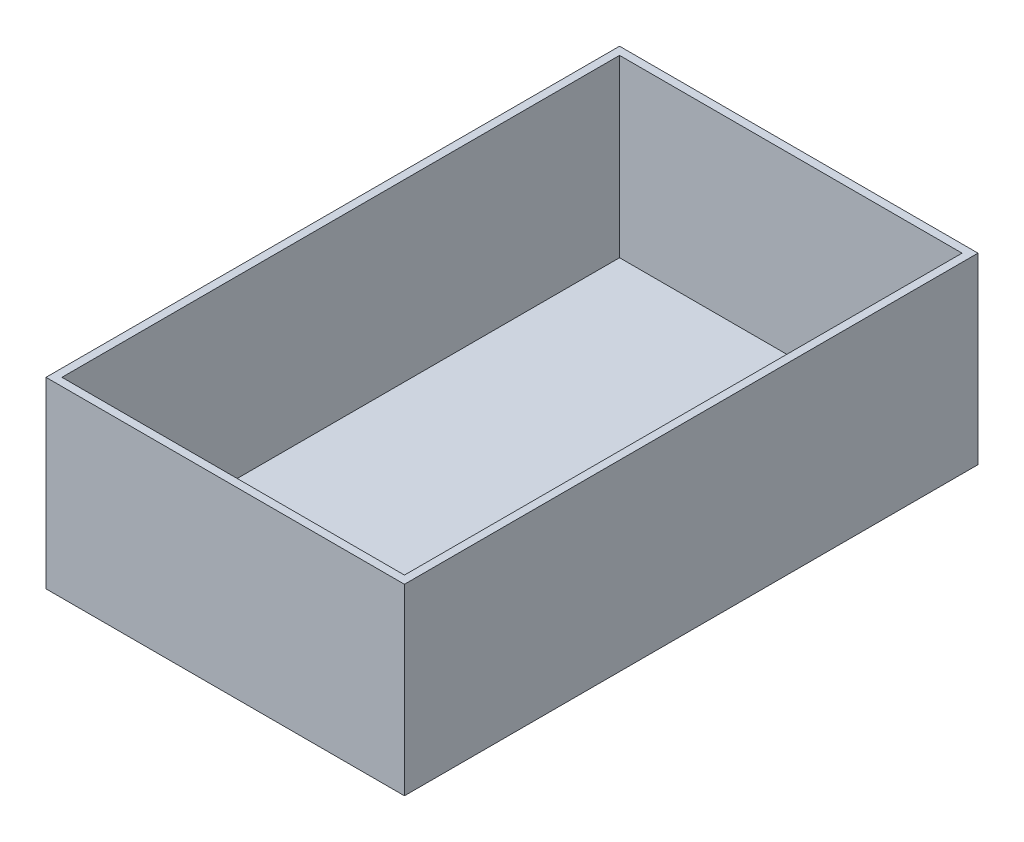
ISO-10303-21;
HEADER;
FILE_DESCRIPTION(('STEP AP214'),'2;1');
FILE_NAME('part.step','',(''),(''),'','','');
FILE_SCHEMA(('AUTOMOTIVE_DESIGN { 1 0 10303 214 1 1 1 1 }'));
ENDSEC;
DATA;
#1=APPLICATION_CONTEXT('core data for automotive mechanical design processes');
#2=APPLICATION_PROTOCOL_DEFINITION('international standard','automotive_design',2000,#1);
#3=PRODUCT_CONTEXT('',#1,'mechanical');
#4=PRODUCT('Part','Part','',(#3));
#5=PRODUCT_RELATED_PRODUCT_CATEGORY('part','',(#4));
#6=PRODUCT_DEFINITION_FORMATION('','',#4);
#7=PRODUCT_DEFINITION_CONTEXT('part definition',#1,'design');
#8=PRODUCT_DEFINITION('design','',#6,#7);
#9=PRODUCT_DEFINITION_SHAPE('','',#8);
#10=(LENGTH_UNIT() NAMED_UNIT(*) SI_UNIT(.MILLI.,.METRE.));
#11=(NAMED_UNIT(*) PLANE_ANGLE_UNIT() SI_UNIT($,.RADIAN.));
#12=(NAMED_UNIT(*) SI_UNIT($,.STERADIAN.) SOLID_ANGLE_UNIT());
#13=UNCERTAINTY_MEASURE_WITH_UNIT(LENGTH_MEASURE(1.E-05),#10,'distance_accuracy_value','');
#14=(GEOMETRIC_REPRESENTATION_CONTEXT(3) GLOBAL_UNCERTAINTY_ASSIGNED_CONTEXT((#13)) GLOBAL_UNIT_ASSIGNED_CONTEXT((#10,
#11,#12)) REPRESENTATION_CONTEXT('',''));
#15=CARTESIAN_POINT('',(0.,0.,0.));
#16=DIRECTION('',(0.,0.,1.));
#17=DIRECTION('',(1.,0.,0.));
#18=AXIS2_PLACEMENT_3D('',#15,#16,#17);
#19=CARTESIAN_POINT('',(-56.7236749116608,69.85,-74.4133613074205));
#20=DIRECTION('',(1.,0.,0.));
#21=DIRECTION('',(0.,0.,-1.));
#22=AXIS2_PLACEMENT_3D('',#19,#20,#21);
#23=PLANE('',#22);
#24=DIRECTION('',(0.,0.,1.));
#25=VECTOR('',#24,1.);
#26=CARTESIAN_POINT('',(-56.7236749116608,-3.175,-74.4133613074205));
#27=LINE('',#26,#25);
#28=CARTESIAN_POINT('',(-56.7236749116608,-3.175,-77.5883613074205));
#29=VERTEX_POINT('',#28);
#30=CARTESIAN_POINT('',(-56.7236749116608,-3.175,151.01163869258));
#31=VERTEX_POINT('',#30);
#32=EDGE_CURVE('E123',#29,#31,#27,.T.);
#33=ORIENTED_EDGE('',*,*,#32,.T.);
#34=DIRECTION('',(0.,-1.,0.));
#35=VECTOR('',#34,1.);
#36=CARTESIAN_POINT('',(-56.7236749116608,69.85,151.01163869258));
#37=LINE('',#36,#35);
#38=CARTESIAN_POINT('',(-56.7236749116608,69.85,151.01163869258));
#39=VERTEX_POINT('',#38);
#40=EDGE_CURVE('E11',#39,#31,#37,.T.);
#41=ORIENTED_EDGE('',*,*,#40,.F.);
#42=DIRECTION('',(0.,0.,1.));
#43=VECTOR('',#42,1.);
#44=CARTESIAN_POINT('',(-56.7236749116608,69.85,-74.4133613074205));
#45=LINE('',#44,#43);
#46=CARTESIAN_POINT('',(-56.7236749116608,69.85,-77.5883613074205));
#47=VERTEX_POINT('',#46);
#48=EDGE_CURVE('E159',#47,#39,#45,.T.);
#49=ORIENTED_EDGE('',*,*,#48,.F.);
#50=DIRECTION('',(0.,-1.,0.));
#51=VECTOR('',#50,1.);
#52=CARTESIAN_POINT('',(-56.7236749116608,69.85,-77.5883613074205));
#53=LINE('',#52,#51);
#54=EDGE_CURVE('E146',#47,#29,#53,.T.);
#55=ORIENTED_EDGE('',*,*,#54,.T.);
#56=EDGE_LOOP('',(#33,#41,#49,#55));
#57=FACE_BOUND('',#56,.T.);
#58=ADVANCED_FACE('F35',(#57),#23,.F.);
#59=CARTESIAN_POINT('',(-53.5486749116608,69.85,151.01163869258));
#60=DIRECTION('',(0.,0.,-1.));
#61=DIRECTION('',(-1.,0.,0.));
#62=AXIS2_PLACEMENT_3D('',#59,#60,#61);
#63=PLANE('',#62);
#64=DIRECTION('',(1.,0.,0.));
#65=VECTOR('',#64,1.);
#66=CARTESIAN_POINT('',(-53.5486749116608,-3.175,151.01163869258));
#67=LINE('',#66,#65);
#68=CARTESIAN_POINT('',(86.1513250883392,-3.175,151.01163869258));
#69=VERTEX_POINT('',#68);
#70=EDGE_CURVE('E144',#31,#69,#67,.T.);
#71=ORIENTED_EDGE('',*,*,#70,.T.);
#72=DIRECTION('',(0.,-1.,0.));
#73=VECTOR('',#72,1.);
#74=CARTESIAN_POINT('',(86.1513250883392,69.85,151.01163869258));
#75=LINE('',#74,#73);
#76=CARTESIAN_POINT('',(86.1513250883392,69.85,151.01163869258));
#77=VERTEX_POINT('',#76);
#78=EDGE_CURVE('E44',#77,#69,#75,.T.);
#79=ORIENTED_EDGE('',*,*,#78,.F.);
#80=DIRECTION('',(1.,0.,0.));
#81=VECTOR('',#80,1.);
#82=CARTESIAN_POINT('',(-53.5486749116608,69.85,151.01163869258));
#83=LINE('',#82,#81);
#84=EDGE_CURVE('E161',#39,#77,#83,.T.);
#85=ORIENTED_EDGE('',*,*,#84,.F.);
#86=ORIENTED_EDGE('',*,*,#40,.T.);
#87=EDGE_LOOP('',(#71,#79,#85,#86));
#88=FACE_BOUND('',#87,.T.);
#89=ADVANCED_FACE('F177',(#88),#63,.F.);
#90=CARTESIAN_POINT('',(86.1513250883392,69.85,-74.4133613074205));
#91=DIRECTION('',(-1.,0.,0.));
#92=DIRECTION('',(0.,0.,1.));
#93=AXIS2_PLACEMENT_3D('',#90,#91,#92);
#94=PLANE('',#93);
#95=DIRECTION('',(0.,0.,-1.));
#96=VECTOR('',#95,1.);
#97=CARTESIAN_POINT('',(86.1513250883392,-3.175,-74.4133613074205));
#98=LINE('',#97,#96);
#99=CARTESIAN_POINT('',(86.1513250883392,-3.175,-77.5883613074205));
#100=VERTEX_POINT('',#99);
#101=EDGE_CURVE('E151',#69,#100,#98,.T.);
#102=ORIENTED_EDGE('',*,*,#101,.T.);
#103=DIRECTION('',(0.,-1.,0.));
#104=VECTOR('',#103,1.);
#105=CARTESIAN_POINT('',(86.1513250883392,69.85,-77.5883613074205));
#106=LINE('',#105,#104);
#107=CARTESIAN_POINT('',(86.1513250883392,69.85,-77.5883613074205));
#108=VERTEX_POINT('',#107);
#109=EDGE_CURVE('E149',#108,#100,#106,.T.);
#110=ORIENTED_EDGE('',*,*,#109,.F.);
#111=DIRECTION('',(0.,0.,-1.));
#112=VECTOR('',#111,1.);
#113=CARTESIAN_POINT('',(86.1513250883392,69.85,-74.4133613074205));
#114=LINE('',#113,#112);
#115=EDGE_CURVE('E162',#77,#108,#114,.T.);
#116=ORIENTED_EDGE('',*,*,#115,.F.);
#117=ORIENTED_EDGE('',*,*,#78,.T.);
#118=EDGE_LOOP('',(#102,#110,#116,#117));
#119=FACE_BOUND('',#118,.T.);
#120=ADVANCED_FACE('F167',(#119),#94,.F.);
#121=CARTESIAN_POINT('',(-53.5486749116608,69.85,-77.5883613074205));
#122=DIRECTION('',(0.,0.,1.));
#123=DIRECTION('',(1.,0.,0.));
#124=AXIS2_PLACEMENT_3D('',#121,#122,#123);
#125=PLANE('',#124);
#126=DIRECTION('',(-1.,0.,0.));
#127=VECTOR('',#126,1.);
#128=CARTESIAN_POINT('',(-53.5486749116608,-3.175,-77.5883613074205));
#129=LINE('',#128,#127);
#130=EDGE_CURVE('E155',#100,#29,#129,.T.);
#131=ORIENTED_EDGE('',*,*,#130,.T.);
#132=ORIENTED_EDGE('',*,*,#54,.F.);
#133=DIRECTION('',(-1.,0.,0.));
#134=VECTOR('',#133,1.);
#135=CARTESIAN_POINT('',(-53.5486749116608,69.85,-77.5883613074205));
#136=LINE('',#135,#134);
#137=EDGE_CURVE('E39',#108,#47,#136,.T.);
#138=ORIENTED_EDGE('',*,*,#137,.F.);
#139=ORIENTED_EDGE('',*,*,#109,.T.);
#140=EDGE_LOOP('',(#131,#132,#138,#139));
#141=FACE_BOUND('',#140,.T.);
#142=ADVANCED_FACE('F171',(#141),#125,.F.);
#143=CARTESIAN_POINT('',(0.,69.85,0.));
#144=DIRECTION('',(0.,1.,0.));
#145=DIRECTION('',(0.,0.,1.));
#146=AXIS2_PLACEMENT_3D('',#143,#144,#145);
#147=PLANE('',#146);
#148=DIRECTION('',(0.,0.,1.));
#149=VECTOR('',#148,1.);
#150=CARTESIAN_POINT('',(-53.5486749116608,69.85,-74.4133613074205));
#151=LINE('',#150,#149);
#152=CARTESIAN_POINT('',(-53.5486749116608,69.85,-74.4133613074205));
#153=VERTEX_POINT('',#152);
#154=CARTESIAN_POINT('',(-53.5486749116608,69.85,147.83663869258));
#155=VERTEX_POINT('',#154);
#156=EDGE_CURVE('E104',#153,#155,#151,.T.);
#157=ORIENTED_EDGE('',*,*,#156,.F.);
#158=DIRECTION('',(-1.,0.,0.));
#159=VECTOR('',#158,1.);
#160=CARTESIAN_POINT('',(-53.5486749116608,69.85,-74.4133613074205));
#161=LINE('',#160,#159);
#162=CARTESIAN_POINT('',(82.9763250883392,69.85,-74.4133613074205));
#163=VERTEX_POINT('',#162);
#164=EDGE_CURVE('E130',#163,#153,#161,.T.);
#165=ORIENTED_EDGE('',*,*,#164,.F.);
#166=DIRECTION('',(0.,0.,-1.));
#167=VECTOR('',#166,1.);
#168=CARTESIAN_POINT('',(82.9763250883392,69.85,-74.4133613074205));
#169=LINE('',#168,#167);
#170=CARTESIAN_POINT('',(82.9763250883392,69.85,147.83663869258));
#171=VERTEX_POINT('',#170);
#172=EDGE_CURVE('E128',#171,#163,#169,.T.);
#173=ORIENTED_EDGE('',*,*,#172,.F.);
#174=DIRECTION('',(1.,0.,0.));
#175=VECTOR('',#174,1.);
#176=CARTESIAN_POINT('',(-53.5486749116608,69.85,147.83663869258));
#177=LINE('',#176,#175);
#178=EDGE_CURVE('E115',#155,#171,#177,.T.);
#179=ORIENTED_EDGE('',*,*,#178,.F.);
#180=EDGE_LOOP('',(#157,#165,#173,#179));
#181=FACE_BOUND('',#180,.T.);
#182=ORIENTED_EDGE('',*,*,#48,.T.);
#183=ORIENTED_EDGE('',*,*,#84,.T.);
#184=ORIENTED_EDGE('',*,*,#115,.T.);
#185=ORIENTED_EDGE('',*,*,#137,.T.);
#186=EDGE_LOOP('',(#182,#183,#184,#185));
#187=FACE_BOUND('',#186,.T.);
#188=ADVANCED_FACE('F127',(#181,#187),#147,.T.);
#189=CARTESIAN_POINT('',(0.,-3.175,0.));
#190=DIRECTION('',(0.,1.,0.));
#191=DIRECTION('',(0.,0.,1.));
#192=AXIS2_PLACEMENT_3D('',#189,#190,#191);
#193=PLANE('',#192);
#194=ORIENTED_EDGE('',*,*,#32,.F.);
#195=ORIENTED_EDGE('',*,*,#130,.F.);
#196=ORIENTED_EDGE('',*,*,#101,.F.);
#197=ORIENTED_EDGE('',*,*,#70,.F.);
#198=EDGE_LOOP('',(#194,#195,#196,#197));
#199=FACE_BOUND('',#198,.T.);
#200=ADVANCED_FACE('F37',(#199),#193,.F.);
#201=CARTESIAN_POINT('',(-53.5486749116608,69.85,-74.4133613074205));
#202=DIRECTION('',(1.,0.,0.));
#203=DIRECTION('',(0.,0.,-1.));
#204=AXIS2_PLACEMENT_3D('',#201,#202,#203);
#205=PLANE('',#204);
#206=DIRECTION('',(0.,0.,1.));
#207=VECTOR('',#206,1.);
#208=CARTESIAN_POINT('',(-53.5486749116608,0.,-74.4133613074205));
#209=LINE('',#208,#207);
#210=CARTESIAN_POINT('',(-53.5486749116608,0.,-74.4133613074205));
#211=VERTEX_POINT('',#210);
#212=CARTESIAN_POINT('',(-53.5486749116608,0.,147.83663869258));
#213=VERTEX_POINT('',#212);
#214=EDGE_CURVE('E134',#211,#213,#209,.T.);
#215=ORIENTED_EDGE('',*,*,#214,.F.);
#216=DIRECTION('',(0.,-1.,0.));
#217=VECTOR('',#216,1.);
#218=CARTESIAN_POINT('',(-53.5486749116608,69.85,-74.4133613074205));
#219=LINE('',#218,#217);
#220=EDGE_CURVE('E111',#153,#211,#219,.T.);
#221=ORIENTED_EDGE('',*,*,#220,.F.);
#222=ORIENTED_EDGE('',*,*,#156,.T.);
#223=DIRECTION('',(0.,-1.,0.));
#224=VECTOR('',#223,1.);
#225=CARTESIAN_POINT('',(-53.5486749116608,69.85,147.83663869258));
#226=LINE('',#225,#224);
#227=EDGE_CURVE('E108',#155,#213,#226,.T.);
#228=ORIENTED_EDGE('',*,*,#227,.T.);
#229=EDGE_LOOP('',(#215,#221,#222,#228));
#230=FACE_BOUND('',#229,.T.);
#231=ADVANCED_FACE('F107',(#230),#205,.T.);
#232=CARTESIAN_POINT('',(-53.5486749116608,69.85,147.83663869258));
#233=DIRECTION('',(0.,0.,-1.));
#234=DIRECTION('',(-1.,0.,0.));
#235=AXIS2_PLACEMENT_3D('',#232,#233,#234);
#236=PLANE('',#235);
#237=DIRECTION('',(1.,0.,0.));
#238=VECTOR('',#237,1.);
#239=CARTESIAN_POINT('',(-53.5486749116608,0.,147.83663869258));
#240=LINE('',#239,#238);
#241=CARTESIAN_POINT('',(82.9763250883392,0.,147.83663869258));
#242=VERTEX_POINT('',#241);
#243=EDGE_CURVE('E122',#213,#242,#240,.T.);
#244=ORIENTED_EDGE('',*,*,#243,.F.);
#245=ORIENTED_EDGE('',*,*,#227,.F.);
#246=ORIENTED_EDGE('',*,*,#178,.T.);
#247=DIRECTION('',(0.,-1.,0.));
#248=VECTOR('',#247,1.);
#249=CARTESIAN_POINT('',(82.9763250883392,69.85,147.83663869258));
#250=LINE('',#249,#248);
#251=EDGE_CURVE('E124',#171,#242,#250,.T.);
#252=ORIENTED_EDGE('',*,*,#251,.T.);
#253=EDGE_LOOP('',(#244,#245,#246,#252));
#254=FACE_BOUND('',#253,.T.);
#255=ADVANCED_FACE('F119',(#254),#236,.T.);
#256=CARTESIAN_POINT('',(82.9763250883392,69.85,-74.4133613074205));
#257=DIRECTION('',(-1.,0.,0.));
#258=DIRECTION('',(0.,0.,1.));
#259=AXIS2_PLACEMENT_3D('',#256,#257,#258);
#260=PLANE('',#259);
#261=DIRECTION('',(0.,0.,-1.));
#262=VECTOR('',#261,1.);
#263=CARTESIAN_POINT('',(82.9763250883392,0.,-74.4133613074205));
#264=LINE('',#263,#262);
#265=CARTESIAN_POINT('',(82.9763250883392,0.,-74.4133613074205));
#266=VERTEX_POINT('',#265);
#267=EDGE_CURVE('E137',#242,#266,#264,.T.);
#268=ORIENTED_EDGE('',*,*,#267,.F.);
#269=ORIENTED_EDGE('',*,*,#251,.F.);
#270=ORIENTED_EDGE('',*,*,#172,.T.);
#271=DIRECTION('',(0.,-1.,0.));
#272=VECTOR('',#271,1.);
#273=CARTESIAN_POINT('',(82.9763250883392,69.85,-74.4133613074205));
#274=LINE('',#273,#272);
#275=EDGE_CURVE('E52',#163,#266,#274,.T.);
#276=ORIENTED_EDGE('',*,*,#275,.T.);
#277=EDGE_LOOP('',(#268,#269,#270,#276));
#278=FACE_BOUND('',#277,.T.);
#279=ADVANCED_FACE('F222',(#278),#260,.T.);
#280=CARTESIAN_POINT('',(-53.5486749116608,69.85,-74.4133613074205));
#281=DIRECTION('',(0.,0.,1.));
#282=DIRECTION('',(1.,0.,0.));
#283=AXIS2_PLACEMENT_3D('',#280,#281,#282);
#284=PLANE('',#283);
#285=DIRECTION('',(-1.,0.,0.));
#286=VECTOR('',#285,1.);
#287=CARTESIAN_POINT('',(-53.5486749116608,0.,-74.4133613074205));
#288=LINE('',#287,#286);
#289=EDGE_CURVE('E116',#266,#211,#288,.T.);
#290=ORIENTED_EDGE('',*,*,#289,.F.);
#291=ORIENTED_EDGE('',*,*,#275,.F.);
#292=ORIENTED_EDGE('',*,*,#164,.T.);
#293=ORIENTED_EDGE('',*,*,#220,.T.);
#294=EDGE_LOOP('',(#290,#291,#292,#293));
#295=FACE_BOUND('',#294,.T.);
#296=ADVANCED_FACE('F231',(#295),#284,.T.);
#297=CARTESIAN_POINT('',(0.,0.,0.));
#298=DIRECTION('',(0.,1.,0.));
#299=DIRECTION('',(0.,0.,1.));
#300=AXIS2_PLACEMENT_3D('',#297,#298,#299);
#301=PLANE('',#300);
#302=ORIENTED_EDGE('',*,*,#214,.T.);
#303=ORIENTED_EDGE('',*,*,#243,.T.);
#304=ORIENTED_EDGE('',*,*,#267,.T.);
#305=ORIENTED_EDGE('',*,*,#289,.T.);
#306=EDGE_LOOP('',(#302,#303,#304,#305));
#307=FACE_BOUND('',#306,.T.);
#308=ADVANCED_FACE('F241',(#307),#301,.T.);
#309=CLOSED_SHELL('',(#58,#89,#120,#142,#188,#200,#231,#255,#279,#296,#308));
#310=MANIFOLD_SOLID_BREP('B2',#309);
#311=ADVANCED_BREP_SHAPE_REPRESENTATION('',(#18,#310),#14);
#312=SHAPE_DEFINITION_REPRESENTATION(#9,#311);
ENDSEC;
END-ISO-10303-21;
